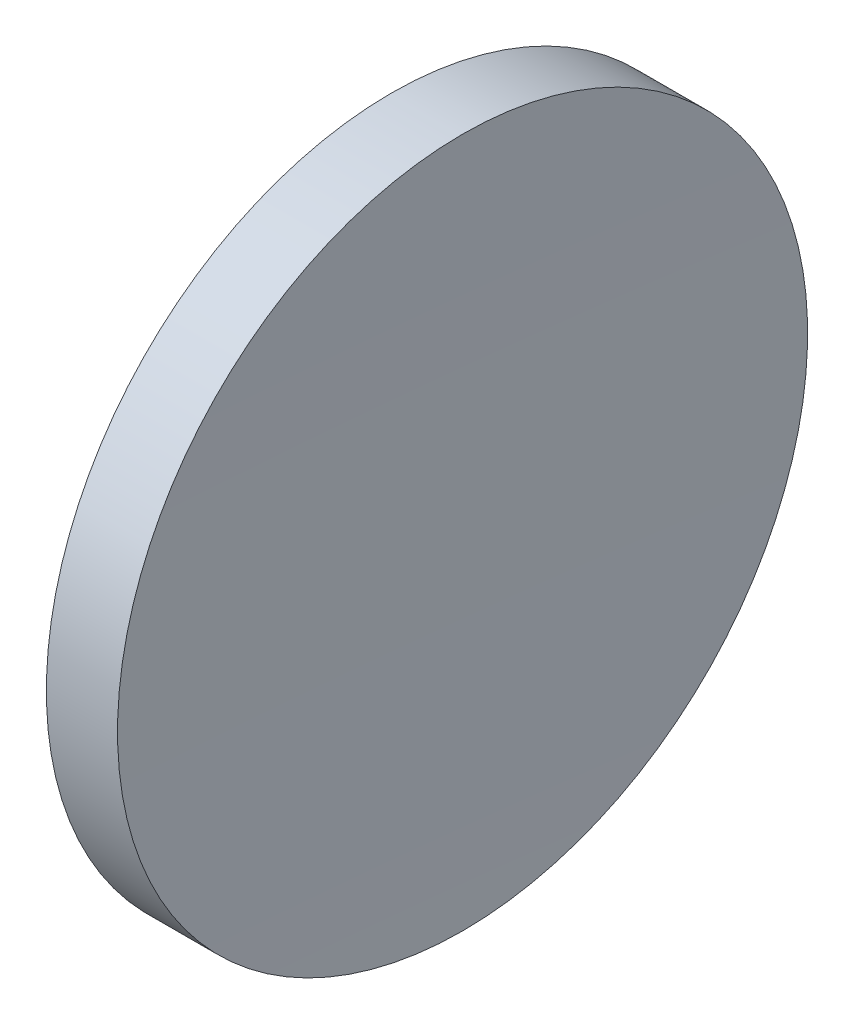
ISO-10303-21;
HEADER;
FILE_DESCRIPTION(('STEP AP214'),'2;1');
FILE_NAME('part.step','',(''),(''),'','','');
FILE_SCHEMA(('AUTOMOTIVE_DESIGN { 1 0 10303 214 1 1 1 1 }'));
ENDSEC;
DATA;
#1=APPLICATION_CONTEXT('core data for automotive mechanical design processes');
#2=APPLICATION_PROTOCOL_DEFINITION('international standard','automotive_design',2000,#1);
#3=PRODUCT_CONTEXT('',#1,'mechanical');
#4=PRODUCT('Part','Part','',(#3));
#5=PRODUCT_RELATED_PRODUCT_CATEGORY('part','',(#4));
#6=PRODUCT_DEFINITION_FORMATION('','',#4);
#7=PRODUCT_DEFINITION_CONTEXT('part definition',#1,'design');
#8=PRODUCT_DEFINITION('design','',#6,#7);
#9=PRODUCT_DEFINITION_SHAPE('','',#8);
#10=(LENGTH_UNIT() NAMED_UNIT(*) SI_UNIT(.MILLI.,.METRE.));
#11=(NAMED_UNIT(*) PLANE_ANGLE_UNIT() SI_UNIT($,.RADIAN.));
#12=(NAMED_UNIT(*) SI_UNIT($,.STERADIAN.) SOLID_ANGLE_UNIT());
#13=UNCERTAINTY_MEASURE_WITH_UNIT(LENGTH_MEASURE(1.E-05),#10,'distance_accuracy_value','');
#14=(GEOMETRIC_REPRESENTATION_CONTEXT(3) GLOBAL_UNCERTAINTY_ASSIGNED_CONTEXT((#13)) GLOBAL_UNIT_ASSIGNED_CONTEXT((#10,
#11,#12)) REPRESENTATION_CONTEXT('',''));
#15=CARTESIAN_POINT('',(0.,0.,0.));
#16=DIRECTION('',(0.,0.,1.));
#17=DIRECTION('',(1.,0.,0.));
#18=AXIS2_PLACEMENT_3D('',#15,#16,#17);
#19=CARTESIAN_POINT('',(347.612193699276,65.2168404709401,0.));
#20=DIRECTION('',(-1.,0.,0.));
#21=DIRECTION('',(0.,1.,0.));
#22=AXIS2_PLACEMENT_3D('',#19,#20,#21);
#23=SPHERICAL_SURFACE('',#22,225.);
#24=CARTESIAN_POINT('',(122.959684254133,65.2168404709403,0.));
#25=DIRECTION('',(-1.,0.,0.));
#26=DIRECTION('',(0.,-1.,0.));
#27=AXIS2_PLACEMENT_3D('',#24,#25,#26);
#28=CIRCLE('',#27,12.5);
#29=CARTESIAN_POINT('',(122.959684254133,52.7168404709403,0.));
#30=VERTEX_POINT('',#29);
#31=EDGE_CURVE('E41',#30,#30,#28,.T.);
#32=ORIENTED_EDGE('',*,*,#31,.T.);
#33=EDGE_LOOP('',(#32));
#34=FACE_BOUND('',#33,.T.);
#35=ADVANCED_FACE('F35',(#34),#23,.T.);
#36=CARTESIAN_POINT('',(746.412193693522,65.2168404709404,0.));
#37=DIRECTION('',(-1.,0.,0.));
#38=DIRECTION('',(0.,1.,0.));
#39=AXIS2_PLACEMENT_3D('',#36,#37,#38);
#40=SPHERICAL_SURFACE('',#39,621.);
#41=CARTESIAN_POINT('',(125.538011592188,65.2168404709403,0.));
#42=DIRECTION('',(-1.,0.,0.));
#43=DIRECTION('',(0.,-1.,0.));
#44=AXIS2_PLACEMENT_3D('',#41,#42,#43);
#45=CIRCLE('',#44,12.5);
#46=CARTESIAN_POINT('',(125.538011592188,52.7168404709403,0.));
#47=VERTEX_POINT('',#46);
#48=EDGE_CURVE('E10',#47,#47,#45,.T.);
#49=ORIENTED_EDGE('',*,*,#48,.F.);
#50=EDGE_LOOP('',(#49));
#51=FACE_BOUND('',#50,.T.);
#52=ADVANCED_FACE('F50',(#51),#40,.F.);
#53=CARTESIAN_POINT('',(115.944491297963,65.2168404709403,0.));
#54=DIRECTION('',(-1.,0.,0.));
#55=DIRECTION('',(0.,-1.,0.));
#56=AXIS2_PLACEMENT_3D('',#53,#54,#55);
#57=CYLINDRICAL_SURFACE('',#56,12.5);
#58=ORIENTED_EDGE('',*,*,#31,.F.);
#59=EDGE_LOOP('',(#58));
#60=FACE_BOUND('',#59,.T.);
#61=ORIENTED_EDGE('',*,*,#48,.T.);
#62=EDGE_LOOP('',(#61));
#63=FACE_BOUND('',#62,.T.);
#64=ADVANCED_FACE('F48',(#60,#63),#57,.T.);
#65=CLOSED_SHELL('',(#35,#52,#64));
#66=MANIFOLD_SOLID_BREP('B2',#65);
#67=ADVANCED_BREP_SHAPE_REPRESENTATION('',(#18,#66),#14);
#68=SHAPE_DEFINITION_REPRESENTATION(#9,#67);
ENDSEC;
END-ISO-10303-21;
